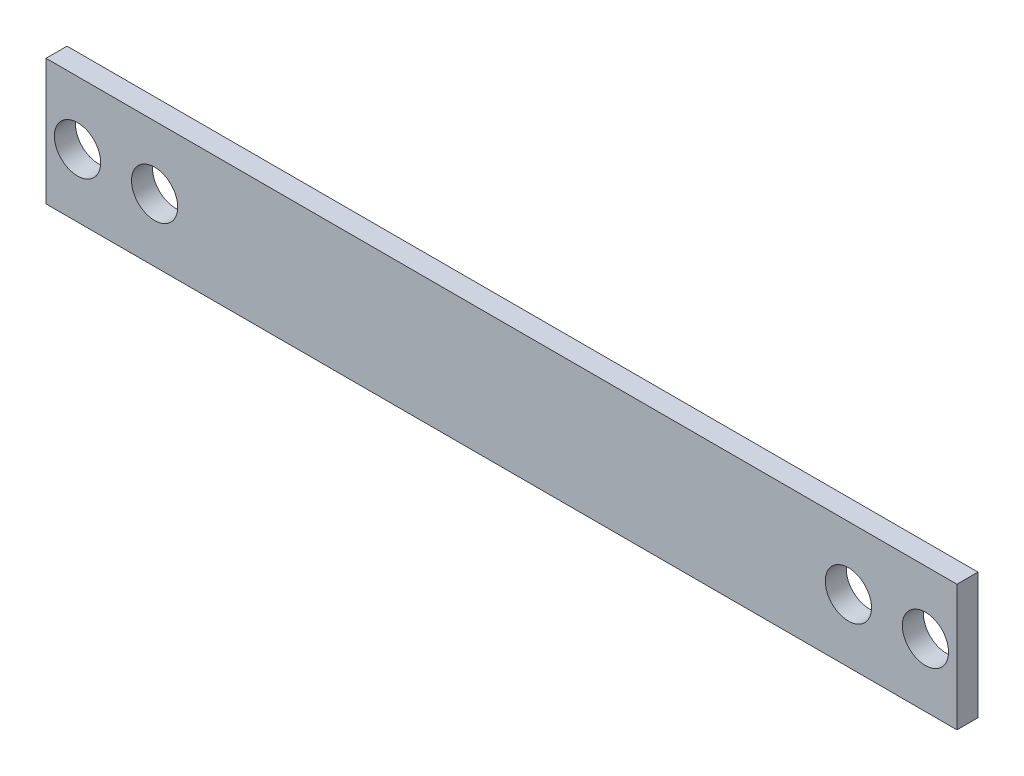
ISO-10303-21;
HEADER;
FILE_DESCRIPTION(('STEP AP214'),'2;1');
FILE_NAME('part.step','',(''),(''),'','','');
FILE_SCHEMA(('AUTOMOTIVE_DESIGN { 1 0 10303 214 1 1 1 1 }'));
ENDSEC;
DATA;
#1=APPLICATION_CONTEXT('core data for automotive mechanical design processes');
#2=APPLICATION_PROTOCOL_DEFINITION('international standard','automotive_design',2000,#1);
#3=PRODUCT_CONTEXT('',#1,'mechanical');
#4=PRODUCT('Part','Part','',(#3));
#5=PRODUCT_RELATED_PRODUCT_CATEGORY('part','',(#4));
#6=PRODUCT_DEFINITION_FORMATION('','',#4);
#7=PRODUCT_DEFINITION_CONTEXT('part definition',#1,'design');
#8=PRODUCT_DEFINITION('design','',#6,#7);
#9=PRODUCT_DEFINITION_SHAPE('','',#8);
#10=(LENGTH_UNIT() NAMED_UNIT(*) SI_UNIT(.MILLI.,.METRE.));
#11=(NAMED_UNIT(*) PLANE_ANGLE_UNIT() SI_UNIT($,.RADIAN.));
#12=(NAMED_UNIT(*) SI_UNIT($,.STERADIAN.) SOLID_ANGLE_UNIT());
#13=UNCERTAINTY_MEASURE_WITH_UNIT(LENGTH_MEASURE(1.E-05),#10,'distance_accuracy_value','');
#14=(GEOMETRIC_REPRESENTATION_CONTEXT(3) GLOBAL_UNCERTAINTY_ASSIGNED_CONTEXT((#13)) GLOBAL_UNIT_ASSIGNED_CONTEXT((#10,
#11,#12)) REPRESENTATION_CONTEXT('',''));
#15=CARTESIAN_POINT('',(0.,0.,0.));
#16=DIRECTION('',(0.,0.,1.));
#17=DIRECTION('',(1.,0.,0.));
#18=AXIS2_PLACEMENT_3D('',#15,#16,#17);
#19=CARTESIAN_POINT('',(0.,0.,1.5));
#20=DIRECTION('',(0.,0.,1.));
#21=DIRECTION('',(1.,0.,0.));
#22=AXIS2_PLACEMENT_3D('',#19,#20,#21);
#23=PLANE('',#22);
#24=CARTESIAN_POINT('',(30.25,0.,1.5));
#25=DIRECTION('',(0.,0.,1.));
#26=DIRECTION('',(1.,0.,0.));
#27=AXIS2_PLACEMENT_3D('',#24,#25,#26);
#28=CIRCLE('',#27,1.65000000000002);
#29=CARTESIAN_POINT('',(31.9,0.,1.5));
#30=VERTEX_POINT('',#29);
#31=EDGE_CURVE('E121',#30,#30,#28,.T.);
#32=ORIENTED_EDGE('',*,*,#31,.F.);
#33=EDGE_LOOP('',(#32));
#34=FACE_BOUND('',#33,.T.);
#35=CARTESIAN_POINT('',(-30.25,0.,1.5));
#36=DIRECTION('',(0.,0.,1.));
#37=DIRECTION('',(1.,0.,0.));
#38=AXIS2_PLACEMENT_3D('',#35,#36,#37);
#39=CIRCLE('',#38,1.65);
#40=CARTESIAN_POINT('',(-28.6,0.,1.5));
#41=VERTEX_POINT('',#40);
#42=EDGE_CURVE('E100',#41,#41,#39,.T.);
#43=ORIENTED_EDGE('',*,*,#42,.F.);
#44=EDGE_LOOP('',(#43));
#45=FACE_BOUND('',#44,.T.);
#46=DIRECTION('',(0.,1.,0.));
#47=VECTOR('',#46,1.);
#48=CARTESIAN_POINT('',(32.5,4.5,1.5));
#49=LINE('',#48,#47);
#50=CARTESIAN_POINT('',(32.5,-4.5,1.5));
#51=VERTEX_POINT('',#50);
#52=CARTESIAN_POINT('',(32.5,4.5,1.5));
#53=VERTEX_POINT('',#52);
#54=EDGE_CURVE('E85',#51,#53,#49,.T.);
#55=ORIENTED_EDGE('',*,*,#54,.T.);
#56=DIRECTION('',(-1.,0.,0.));
#57=VECTOR('',#56,1.);
#58=CARTESIAN_POINT('',(-32.5,4.5,1.5));
#59=LINE('',#58,#57);
#60=CARTESIAN_POINT('',(-32.5,4.5,1.5));
#61=VERTEX_POINT('',#60);
#62=EDGE_CURVE('E80',#53,#61,#59,.T.);
#63=ORIENTED_EDGE('',*,*,#62,.T.);
#64=DIRECTION('',(0.,-1.,0.));
#65=VECTOR('',#64,1.);
#66=CARTESIAN_POINT('',(-32.5,4.5,1.5));
#67=LINE('',#66,#65);
#68=CARTESIAN_POINT('',(-32.5,-4.5,1.5));
#69=VERTEX_POINT('',#68);
#70=EDGE_CURVE('E83',#61,#69,#67,.T.);
#71=ORIENTED_EDGE('',*,*,#70,.T.);
#72=DIRECTION('',(1.,0.,0.));
#73=VECTOR('',#72,1.);
#74=CARTESIAN_POINT('',(-32.5,-4.5,1.5));
#75=LINE('',#74,#73);
#76=EDGE_CURVE('E50',#69,#51,#75,.T.);
#77=ORIENTED_EDGE('',*,*,#76,.T.);
#78=EDGE_LOOP('',(#55,#63,#71,#77));
#79=FACE_BOUND('',#78,.T.);
#80=CARTESIAN_POINT('',(24.75,0.,1.5));
#81=DIRECTION('',(0.,0.,1.));
#82=DIRECTION('',(1.,0.,0.));
#83=AXIS2_PLACEMENT_3D('',#80,#81,#82);
#84=CIRCLE('',#83,1.65);
#85=CARTESIAN_POINT('',(26.4,0.,1.5));
#86=VERTEX_POINT('',#85);
#87=EDGE_CURVE('E115',#86,#86,#84,.T.);
#88=ORIENTED_EDGE('',*,*,#87,.F.);
#89=EDGE_LOOP('',(#88));
#90=FACE_BOUND('',#89,.T.);
#91=CARTESIAN_POINT('',(-24.75,0.,1.5));
#92=DIRECTION('',(0.,0.,1.));
#93=DIRECTION('',(1.,0.,0.));
#94=AXIS2_PLACEMENT_3D('',#91,#92,#93);
#95=CIRCLE('',#94,1.65);
#96=CARTESIAN_POINT('',(-23.1,0.,1.5));
#97=VERTEX_POINT('',#96);
#98=EDGE_CURVE('E127',#97,#97,#95,.T.);
#99=ORIENTED_EDGE('',*,*,#98,.F.);
#100=EDGE_LOOP('',(#99));
#101=FACE_BOUND('',#100,.T.);
#102=ADVANCED_FACE('F33',(#34,#45,#79,#90,#101),#23,.T.);
#103=CARTESIAN_POINT('',(0.,0.,0.));
#104=DIRECTION('',(0.,0.,1.));
#105=DIRECTION('',(1.,0.,0.));
#106=AXIS2_PLACEMENT_3D('',#103,#104,#105);
#107=PLANE('',#106);
#108=DIRECTION('',(0.,1.,0.));
#109=VECTOR('',#108,1.);
#110=CARTESIAN_POINT('',(32.5,4.5,0.));
#111=LINE('',#110,#109);
#112=CARTESIAN_POINT('',(32.5,-4.5,0.));
#113=VERTEX_POINT('',#112);
#114=CARTESIAN_POINT('',(32.5,4.5,0.));
#115=VERTEX_POINT('',#114);
#116=EDGE_CURVE('E97',#113,#115,#111,.T.);
#117=ORIENTED_EDGE('',*,*,#116,.F.);
#118=DIRECTION('',(1.,0.,0.));
#119=VECTOR('',#118,1.);
#120=CARTESIAN_POINT('',(-32.5,-4.5,0.));
#121=LINE('',#120,#119);
#122=CARTESIAN_POINT('',(-32.5,-4.5,0.));
#123=VERTEX_POINT('',#122);
#124=EDGE_CURVE('E73',#123,#113,#121,.T.);
#125=ORIENTED_EDGE('',*,*,#124,.F.);
#126=DIRECTION('',(0.,-1.,0.));
#127=VECTOR('',#126,1.);
#128=CARTESIAN_POINT('',(-32.5,4.5,0.));
#129=LINE('',#128,#127);
#130=CARTESIAN_POINT('',(-32.5,4.5,0.));
#131=VERTEX_POINT('',#130);
#132=EDGE_CURVE('E67',#131,#123,#129,.T.);
#133=ORIENTED_EDGE('',*,*,#132,.F.);
#134=DIRECTION('',(-1.,0.,0.));
#135=VECTOR('',#134,1.);
#136=CARTESIAN_POINT('',(-32.5,4.5,0.));
#137=LINE('',#136,#135);
#138=EDGE_CURVE('E89',#115,#131,#137,.T.);
#139=ORIENTED_EDGE('',*,*,#138,.F.);
#140=EDGE_LOOP('',(#117,#125,#133,#139));
#141=FACE_BOUND('',#140,.T.);
#142=CARTESIAN_POINT('',(-30.25,0.,0.));
#143=DIRECTION('',(0.,0.,1.));
#144=DIRECTION('',(1.,0.,0.));
#145=AXIS2_PLACEMENT_3D('',#142,#143,#144);
#146=CIRCLE('',#145,1.65);
#147=CARTESIAN_POINT('',(-28.6,0.,0.));
#148=VERTEX_POINT('',#147);
#149=EDGE_CURVE('E112',#148,#148,#146,.T.);
#150=ORIENTED_EDGE('',*,*,#149,.T.);
#151=EDGE_LOOP('',(#150));
#152=FACE_BOUND('',#151,.T.);
#153=CARTESIAN_POINT('',(24.75,0.,0.));
#154=DIRECTION('',(0.,0.,1.));
#155=DIRECTION('',(1.,0.,0.));
#156=AXIS2_PLACEMENT_3D('',#153,#154,#155);
#157=CIRCLE('',#156,1.65);
#158=CARTESIAN_POINT('',(26.4,0.,0.));
#159=VERTEX_POINT('',#158);
#160=EDGE_CURVE('E118',#159,#159,#157,.T.);
#161=ORIENTED_EDGE('',*,*,#160,.T.);
#162=EDGE_LOOP('',(#161));
#163=FACE_BOUND('',#162,.T.);
#164=CARTESIAN_POINT('',(30.25,0.,0.));
#165=DIRECTION('',(0.,0.,1.));
#166=DIRECTION('',(1.,0.,0.));
#167=AXIS2_PLACEMENT_3D('',#164,#165,#166);
#168=CIRCLE('',#167,1.65000000000002);
#169=CARTESIAN_POINT('',(31.9,0.,0.));
#170=VERTEX_POINT('',#169);
#171=EDGE_CURVE('E124',#170,#170,#168,.T.);
#172=ORIENTED_EDGE('',*,*,#171,.T.);
#173=EDGE_LOOP('',(#172));
#174=FACE_BOUND('',#173,.T.);
#175=CARTESIAN_POINT('',(-24.75,0.,0.));
#176=DIRECTION('',(0.,0.,1.));
#177=DIRECTION('',(1.,0.,0.));
#178=AXIS2_PLACEMENT_3D('',#175,#176,#177);
#179=CIRCLE('',#178,1.65);
#180=CARTESIAN_POINT('',(-23.1,0.,0.));
#181=VERTEX_POINT('',#180);
#182=EDGE_CURVE('E130',#181,#181,#179,.T.);
#183=ORIENTED_EDGE('',*,*,#182,.T.);
#184=EDGE_LOOP('',(#183));
#185=FACE_BOUND('',#184,.T.);
#186=ADVANCED_FACE('F108',(#141,#152,#163,#174,#185),#107,.F.);
#187=CARTESIAN_POINT('',(32.5,4.5,1.5));
#188=DIRECTION('',(-1.,0.,0.));
#189=DIRECTION('',(0.,0.,1.));
#190=AXIS2_PLACEMENT_3D('',#187,#188,#189);
#191=PLANE('',#190);
#192=ORIENTED_EDGE('',*,*,#116,.T.);
#193=DIRECTION('',(0.,0.,-1.));
#194=VECTOR('',#193,1.);
#195=CARTESIAN_POINT('',(32.5,4.5,1.5));
#196=LINE('',#195,#194);
#197=EDGE_CURVE('E11',#53,#115,#196,.T.);
#198=ORIENTED_EDGE('',*,*,#197,.F.);
#199=ORIENTED_EDGE('',*,*,#54,.F.);
#200=DIRECTION('',(0.,0.,-1.));
#201=VECTOR('',#200,1.);
#202=CARTESIAN_POINT('',(32.5,-4.5,1.5));
#203=LINE('',#202,#201);
#204=EDGE_CURVE('E93',#51,#113,#203,.T.);
#205=ORIENTED_EDGE('',*,*,#204,.T.);
#206=EDGE_LOOP('',(#192,#198,#199,#205));
#207=FACE_BOUND('',#206,.T.);
#208=ADVANCED_FACE('F35',(#207),#191,.F.);
#209=CARTESIAN_POINT('',(-32.5,4.5,1.5));
#210=DIRECTION('',(0.,-1.,0.));
#211=DIRECTION('',(0.,0.,-1.));
#212=AXIS2_PLACEMENT_3D('',#209,#210,#211);
#213=PLANE('',#212);
#214=ORIENTED_EDGE('',*,*,#138,.T.);
#215=DIRECTION('',(0.,0.,-1.));
#216=VECTOR('',#215,1.);
#217=CARTESIAN_POINT('',(-32.5,4.5,1.5));
#218=LINE('',#217,#216);
#219=EDGE_CURVE('E42',#61,#131,#218,.T.);
#220=ORIENTED_EDGE('',*,*,#219,.F.);
#221=ORIENTED_EDGE('',*,*,#62,.F.);
#222=ORIENTED_EDGE('',*,*,#197,.T.);
#223=EDGE_LOOP('',(#214,#220,#221,#222));
#224=FACE_BOUND('',#223,.T.);
#225=ADVANCED_FACE('F88',(#224),#213,.F.);
#226=CARTESIAN_POINT('',(-32.5,4.5,1.5));
#227=DIRECTION('',(1.,0.,0.));
#228=DIRECTION('',(0.,0.,-1.));
#229=AXIS2_PLACEMENT_3D('',#226,#227,#228);
#230=PLANE('',#229);
#231=ORIENTED_EDGE('',*,*,#132,.T.);
#232=DIRECTION('',(0.,0.,-1.));
#233=VECTOR('',#232,1.);
#234=CARTESIAN_POINT('',(-32.5,-4.5,1.5));
#235=LINE('',#234,#233);
#236=EDGE_CURVE('E90',#69,#123,#235,.T.);
#237=ORIENTED_EDGE('',*,*,#236,.F.);
#238=ORIENTED_EDGE('',*,*,#70,.F.);
#239=ORIENTED_EDGE('',*,*,#219,.T.);
#240=EDGE_LOOP('',(#231,#237,#238,#239));
#241=FACE_BOUND('',#240,.T.);
#242=ADVANCED_FACE('F91',(#241),#230,.F.);
#243=CARTESIAN_POINT('',(-32.5,-4.5,1.5));
#244=DIRECTION('',(0.,1.,0.));
#245=DIRECTION('',(0.,0.,1.));
#246=AXIS2_PLACEMENT_3D('',#243,#244,#245);
#247=PLANE('',#246);
#248=ORIENTED_EDGE('',*,*,#124,.T.);
#249=ORIENTED_EDGE('',*,*,#204,.F.);
#250=ORIENTED_EDGE('',*,*,#76,.F.);
#251=ORIENTED_EDGE('',*,*,#236,.T.);
#252=EDGE_LOOP('',(#248,#249,#250,#251));
#253=FACE_BOUND('',#252,.T.);
#254=ADVANCED_FACE('F105',(#253),#247,.F.);
#255=CARTESIAN_POINT('',(-30.25,0.,1.5));
#256=DIRECTION('',(0.,0.,-1.));
#257=DIRECTION('',(-1.,0.,0.));
#258=AXIS2_PLACEMENT_3D('',#255,#256,#257);
#259=CYLINDRICAL_SURFACE('',#258,1.65);
#260=ORIENTED_EDGE('',*,*,#42,.T.);
#261=EDGE_LOOP('',(#260));
#262=FACE_BOUND('',#261,.T.);
#263=ORIENTED_EDGE('',*,*,#149,.F.);
#264=EDGE_LOOP('',(#263));
#265=FACE_BOUND('',#264,.T.);
#266=ADVANCED_FACE('F149',(#262,#265),#259,.F.);
#267=CARTESIAN_POINT('',(24.75,0.,1.5));
#268=DIRECTION('',(0.,0.,-1.));
#269=DIRECTION('',(-1.,0.,0.));
#270=AXIS2_PLACEMENT_3D('',#267,#268,#269);
#271=CYLINDRICAL_SURFACE('',#270,1.65);
#272=ORIENTED_EDGE('',*,*,#87,.T.);
#273=EDGE_LOOP('',(#272));
#274=FACE_BOUND('',#273,.T.);
#275=ORIENTED_EDGE('',*,*,#160,.F.);
#276=EDGE_LOOP('',(#275));
#277=FACE_BOUND('',#276,.T.);
#278=ADVANCED_FACE('F195',(#274,#277),#271,.F.);
#279=CARTESIAN_POINT('',(30.25,0.,1.5));
#280=DIRECTION('',(0.,0.,-1.));
#281=DIRECTION('',(-1.,0.,0.));
#282=AXIS2_PLACEMENT_3D('',#279,#280,#281);
#283=CYLINDRICAL_SURFACE('',#282,1.65000000000002);
#284=ORIENTED_EDGE('',*,*,#31,.T.);
#285=EDGE_LOOP('',(#284));
#286=FACE_BOUND('',#285,.T.);
#287=ORIENTED_EDGE('',*,*,#171,.F.);
#288=EDGE_LOOP('',(#287));
#289=FACE_BOUND('',#288,.T.);
#290=ADVANCED_FACE('F203',(#286,#289),#283,.F.);
#291=CARTESIAN_POINT('',(-24.75,0.,1.5));
#292=DIRECTION('',(0.,0.,-1.));
#293=DIRECTION('',(-1.,0.,0.));
#294=AXIS2_PLACEMENT_3D('',#291,#292,#293);
#295=CYLINDRICAL_SURFACE('',#294,1.65);
#296=ORIENTED_EDGE('',*,*,#98,.T.);
#297=EDGE_LOOP('',(#296));
#298=FACE_BOUND('',#297,.T.);
#299=ORIENTED_EDGE('',*,*,#182,.F.);
#300=EDGE_LOOP('',(#299));
#301=FACE_BOUND('',#300,.T.);
#302=ADVANCED_FACE('F136',(#298,#301),#295,.F.);
#303=CLOSED_SHELL('',(#102,#186,#208,#225,#242,#254,#266,#278,#290,#302));
#304=MANIFOLD_SOLID_BREP('B2',#303);
#305=ADVANCED_BREP_SHAPE_REPRESENTATION('',(#18,#304),#14);
#306=SHAPE_DEFINITION_REPRESENTATION(#9,#305);
ENDSEC;
END-ISO-10303-21;
